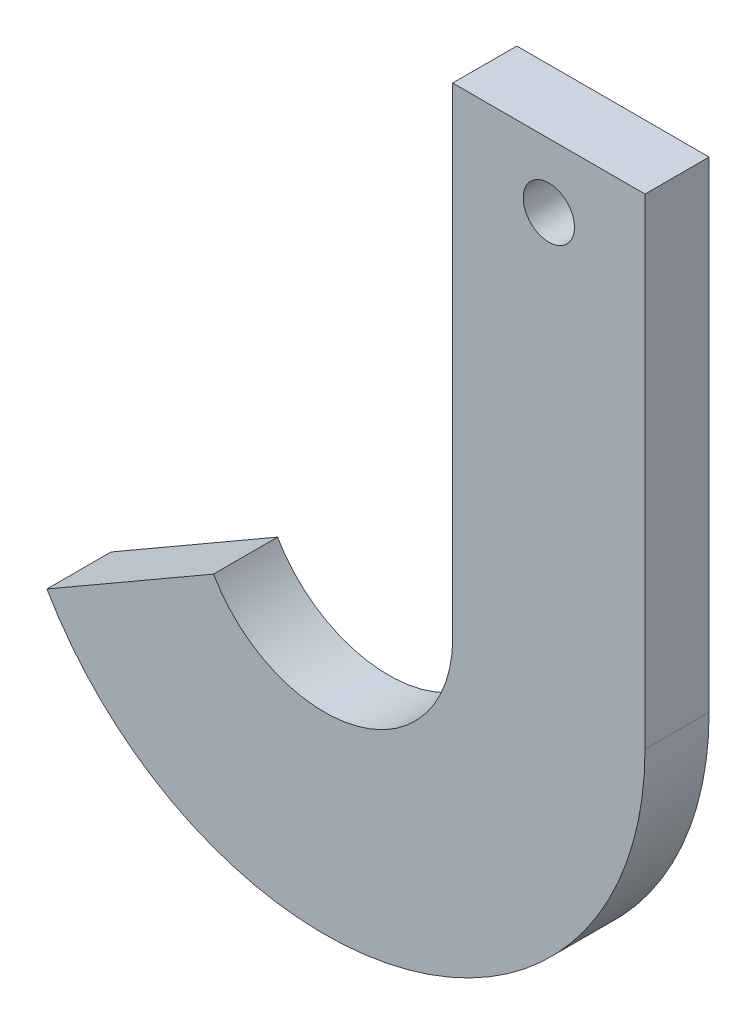
ISO-10303-21;
HEADER;
FILE_DESCRIPTION(('STEP AP214'),'2;1');
FILE_NAME('part.step','',(''),(''),'','','');
FILE_SCHEMA(('AUTOMOTIVE_DESIGN { 1 0 10303 214 1 1 1 1 }'));
ENDSEC;
DATA;
#1=APPLICATION_CONTEXT('core data for automotive mechanical design processes');
#2=APPLICATION_PROTOCOL_DEFINITION('international standard','automotive_design',2000,#1);
#3=PRODUCT_CONTEXT('',#1,'mechanical');
#4=PRODUCT('Part','Part','',(#3));
#5=PRODUCT_RELATED_PRODUCT_CATEGORY('part','',(#4));
#6=PRODUCT_DEFINITION_FORMATION('','',#4);
#7=PRODUCT_DEFINITION_CONTEXT('part definition',#1,'design');
#8=PRODUCT_DEFINITION('design','',#6,#7);
#9=PRODUCT_DEFINITION_SHAPE('','',#8);
#10=(LENGTH_UNIT() NAMED_UNIT(*) SI_UNIT(.MILLI.,.METRE.));
#11=(NAMED_UNIT(*) PLANE_ANGLE_UNIT() SI_UNIT($,.RADIAN.));
#12=(NAMED_UNIT(*) SI_UNIT($,.STERADIAN.) SOLID_ANGLE_UNIT());
#13=UNCERTAINTY_MEASURE_WITH_UNIT(LENGTH_MEASURE(1.E-05),#10,'distance_accuracy_value','');
#14=(GEOMETRIC_REPRESENTATION_CONTEXT(3) GLOBAL_UNCERTAINTY_ASSIGNED_CONTEXT((#13)) GLOBAL_UNIT_ASSIGNED_CONTEXT((#10,
#11,#12)) REPRESENTATION_CONTEXT('',''));
#15=CARTESIAN_POINT('',(0.,0.,0.));
#16=DIRECTION('',(0.,0.,1.));
#17=DIRECTION('',(1.,0.,0.));
#18=AXIS2_PLACEMENT_3D('',#15,#16,#17);
#19=CARTESIAN_POINT('',(0.,0.,20.));
#20=DIRECTION('',(0.,0.,1.));
#21=DIRECTION('',(1.,0.,0.));
#22=AXIS2_PLACEMENT_3D('',#19,#20,#21);
#23=PLANE('',#22);
#24=CARTESIAN_POINT('',(0.,0.,20.));
#25=DIRECTION('',(0.,0.,-1.));
#26=DIRECTION('',(1.,0.,0.));
#27=AXIS2_PLACEMENT_3D('',#24,#25,#26);
#28=CIRCLE('',#27,40.);
#29=CARTESIAN_POINT('',(40.,0.,20.));
#30=VERTEX_POINT('',#29);
#31=CARTESIAN_POINT('',(-34.6410161513775,-20.0000000000001,20.));
#32=VERTEX_POINT('',#31);
#33=EDGE_CURVE('E128',#30,#32,#28,.T.);
#34=ORIENTED_EDGE('',*,*,#33,.T.);
#35=DIRECTION('',(-0.866025403784438,-0.500000000000001,0.));
#36=VECTOR('',#35,1.);
#37=CARTESIAN_POINT('',(-34.6410161513775,-20.0000000000001,20.));
#38=LINE('',#37,#36);
#39=CARTESIAN_POINT('',(-86.6025403784438,-50.0000000000001,20.));
#40=VERTEX_POINT('',#39);
#41=EDGE_CURVE('E86',#32,#40,#38,.T.);
#42=ORIENTED_EDGE('',*,*,#41,.T.);
#43=CARTESIAN_POINT('',(0.,0.,20.));
#44=DIRECTION('',(0.,0.,1.));
#45=DIRECTION('',(1.,0.,0.));
#46=AXIS2_PLACEMENT_3D('',#43,#44,#45);
#47=CIRCLE('',#46,100.);
#48=CARTESIAN_POINT('',(100.,0.,20.));
#49=VERTEX_POINT('',#48);
#50=EDGE_CURVE('E99',#40,#49,#47,.T.);
#51=ORIENTED_EDGE('',*,*,#50,.T.);
#52=DIRECTION('',(0.,1.,0.));
#53=VECTOR('',#52,1.);
#54=CARTESIAN_POINT('',(100.,0.,20.));
#55=LINE('',#54,#53);
#56=CARTESIAN_POINT('',(100.,150.,20.));
#57=VERTEX_POINT('',#56);
#58=EDGE_CURVE('E93',#49,#57,#55,.T.);
#59=ORIENTED_EDGE('',*,*,#58,.T.);
#60=DIRECTION('',(-1.,0.,0.));
#61=VECTOR('',#60,1.);
#62=CARTESIAN_POINT('',(40.,150.,20.));
#63=LINE('',#62,#61);
#64=CARTESIAN_POINT('',(40.,150.,20.));
#65=VERTEX_POINT('',#64);
#66=EDGE_CURVE('E97',#57,#65,#63,.T.);
#67=ORIENTED_EDGE('',*,*,#66,.T.);
#68=DIRECTION('',(0.,-1.,0.));
#69=VECTOR('',#68,1.);
#70=CARTESIAN_POINT('',(40.,150.,20.));
#71=LINE('',#70,#69);
#72=EDGE_CURVE('E49',#65,#30,#71,.T.);
#73=ORIENTED_EDGE('',*,*,#72,.T.);
#74=EDGE_LOOP('',(#34,#42,#51,#59,#67,#73));
#75=FACE_BOUND('',#74,.T.);
#76=CARTESIAN_POINT('',(70.,130.,20.));
#77=DIRECTION('',(0.,0.,1.));
#78=DIRECTION('',(1.,0.,0.));
#79=AXIS2_PLACEMENT_3D('',#76,#77,#78);
#80=CIRCLE('',#79,8.00000000000001);
#81=CARTESIAN_POINT('',(78.,130.,20.));
#82=VERTEX_POINT('',#81);
#83=EDGE_CURVE('E121',#82,#82,#80,.T.);
#84=ORIENTED_EDGE('',*,*,#83,.F.);
#85=EDGE_LOOP('',(#84));
#86=FACE_BOUND('',#85,.T.);
#87=ADVANCED_FACE('F32',(#75,#86),#23,.T.);
#88=CARTESIAN_POINT('',(0.,0.,0.));
#89=DIRECTION('',(0.,0.,1.));
#90=DIRECTION('',(1.,0.,0.));
#91=AXIS2_PLACEMENT_3D('',#88,#89,#90);
#92=PLANE('',#91);
#93=CARTESIAN_POINT('',(0.,0.,0.));
#94=DIRECTION('',(0.,0.,-1.));
#95=DIRECTION('',(1.,0.,0.));
#96=AXIS2_PLACEMENT_3D('',#93,#94,#95);
#97=CIRCLE('',#96,40.);
#98=CARTESIAN_POINT('',(40.,0.,0.));
#99=VERTEX_POINT('',#98);
#100=CARTESIAN_POINT('',(-34.6410161513775,-20.0000000000001,0.));
#101=VERTEX_POINT('',#100);
#102=EDGE_CURVE('E117',#99,#101,#97,.T.);
#103=ORIENTED_EDGE('',*,*,#102,.F.);
#104=DIRECTION('',(0.,-1.,0.));
#105=VECTOR('',#104,1.);
#106=CARTESIAN_POINT('',(40.,150.,0.));
#107=LINE('',#106,#105);
#108=CARTESIAN_POINT('',(40.,150.,0.));
#109=VERTEX_POINT('',#108);
#110=EDGE_CURVE('E78',#109,#99,#107,.T.);
#111=ORIENTED_EDGE('',*,*,#110,.F.);
#112=DIRECTION('',(-1.,0.,0.));
#113=VECTOR('',#112,1.);
#114=CARTESIAN_POINT('',(40.,150.,0.));
#115=LINE('',#114,#113);
#116=CARTESIAN_POINT('',(100.,150.,0.));
#117=VERTEX_POINT('',#116);
#118=EDGE_CURVE('E72',#117,#109,#115,.T.);
#119=ORIENTED_EDGE('',*,*,#118,.F.);
#120=DIRECTION('',(0.,1.,0.));
#121=VECTOR('',#120,1.);
#122=CARTESIAN_POINT('',(100.,0.,0.));
#123=LINE('',#122,#121);
#124=CARTESIAN_POINT('',(100.,0.,0.));
#125=VERTEX_POINT('',#124);
#126=EDGE_CURVE('E107',#125,#117,#123,.T.);
#127=ORIENTED_EDGE('',*,*,#126,.F.);
#128=CARTESIAN_POINT('',(0.,0.,0.));
#129=DIRECTION('',(0.,0.,1.));
#130=DIRECTION('',(1.,0.,0.));
#131=AXIS2_PLACEMENT_3D('',#128,#129,#130);
#132=CIRCLE('',#131,100.);
#133=CARTESIAN_POINT('',(-86.6025403784438,-50.0000000000001,0.));
#134=VERTEX_POINT('',#133);
#135=EDGE_CURVE('E123',#134,#125,#132,.T.);
#136=ORIENTED_EDGE('',*,*,#135,.F.);
#137=DIRECTION('',(-0.866025403784438,-0.500000000000001,0.));
#138=VECTOR('',#137,1.);
#139=CARTESIAN_POINT('',(-34.6410161513775,-20.0000000000001,0.));
#140=LINE('',#139,#138);
#141=EDGE_CURVE('E120',#101,#134,#140,.T.);
#142=ORIENTED_EDGE('',*,*,#141,.F.);
#143=EDGE_LOOP('',(#103,#111,#119,#127,#136,#142));
#144=FACE_BOUND('',#143,.T.);
#145=CARTESIAN_POINT('',(70.,130.,0.));
#146=DIRECTION('',(0.,0.,1.));
#147=DIRECTION('',(1.,0.,0.));
#148=AXIS2_PLACEMENT_3D('',#145,#146,#147);
#149=CIRCLE('',#148,8.00000000000001);
#150=CARTESIAN_POINT('',(78.,130.,0.));
#151=VERTEX_POINT('',#150);
#152=EDGE_CURVE('E221',#151,#151,#149,.T.);
#153=ORIENTED_EDGE('',*,*,#152,.T.);
#154=EDGE_LOOP('',(#153));
#155=FACE_BOUND('',#154,.T.);
#156=ADVANCED_FACE('F137',(#144,#155),#92,.F.);
#157=CARTESIAN_POINT('',(0.,0.,20.));
#158=DIRECTION('',(0.,0.,-1.));
#159=DIRECTION('',(-1.,0.,0.));
#160=AXIS2_PLACEMENT_3D('',#157,#158,#159);
#161=CYLINDRICAL_SURFACE('',#160,40.);
#162=ORIENTED_EDGE('',*,*,#102,.T.);
#163=DIRECTION('',(0.,0.,-1.));
#164=VECTOR('',#163,1.);
#165=CARTESIAN_POINT('',(-34.6410161513775,-20.0000000000001,20.));
#166=LINE('',#165,#164);
#167=EDGE_CURVE('E11',#32,#101,#166,.T.);
#168=ORIENTED_EDGE('',*,*,#167,.F.);
#169=ORIENTED_EDGE('',*,*,#33,.F.);
#170=DIRECTION('',(0.,0.,-1.));
#171=VECTOR('',#170,1.);
#172=CARTESIAN_POINT('',(40.,0.,20.));
#173=LINE('',#172,#171);
#174=EDGE_CURVE('E113',#30,#99,#173,.T.);
#175=ORIENTED_EDGE('',*,*,#174,.T.);
#176=EDGE_LOOP('',(#162,#168,#169,#175));
#177=FACE_BOUND('',#176,.T.);
#178=ADVANCED_FACE('F34',(#177),#161,.F.);
#179=CARTESIAN_POINT('',(-34.6410161513775,-20.0000000000001,20.));
#180=DIRECTION('',(0.500000000000001,-0.866025403784438,0.));
#181=DIRECTION('',(0.866025403784438,0.500000000000001,0.));
#182=AXIS2_PLACEMENT_3D('',#179,#180,#181);
#183=PLANE('',#182);
#184=ORIENTED_EDGE('',*,*,#141,.T.);
#185=DIRECTION('',(0.,0.,-1.));
#186=VECTOR('',#185,1.);
#187=CARTESIAN_POINT('',(-86.6025403784438,-50.0000000000001,20.));
#188=LINE('',#187,#186);
#189=EDGE_CURVE('E41',#40,#134,#188,.T.);
#190=ORIENTED_EDGE('',*,*,#189,.F.);
#191=ORIENTED_EDGE('',*,*,#41,.F.);
#192=ORIENTED_EDGE('',*,*,#167,.T.);
#193=EDGE_LOOP('',(#184,#190,#191,#192));
#194=FACE_BOUND('',#193,.T.);
#195=ADVANCED_FACE('F162',(#194),#183,.F.);
#196=CARTESIAN_POINT('',(0.,0.,20.));
#197=DIRECTION('',(0.,0.,-1.));
#198=DIRECTION('',(-1.,0.,0.));
#199=AXIS2_PLACEMENT_3D('',#196,#197,#198);
#200=CYLINDRICAL_SURFACE('',#199,100.);
#201=ORIENTED_EDGE('',*,*,#135,.T.);
#202=DIRECTION('',(0.,0.,-1.));
#203=VECTOR('',#202,1.);
#204=CARTESIAN_POINT('',(100.,0.,20.));
#205=LINE('',#204,#203);
#206=EDGE_CURVE('E108',#49,#125,#205,.T.);
#207=ORIENTED_EDGE('',*,*,#206,.F.);
#208=ORIENTED_EDGE('',*,*,#50,.F.);
#209=ORIENTED_EDGE('',*,*,#189,.T.);
#210=EDGE_LOOP('',(#201,#207,#208,#209));
#211=FACE_BOUND('',#210,.T.);
#212=ADVANCED_FACE('F134',(#211),#200,.T.);
#213=CARTESIAN_POINT('',(100.,0.,20.));
#214=DIRECTION('',(-1.,0.,0.));
#215=DIRECTION('',(0.,0.,1.));
#216=AXIS2_PLACEMENT_3D('',#213,#214,#215);
#217=PLANE('',#216);
#218=ORIENTED_EDGE('',*,*,#126,.T.);
#219=DIRECTION('',(0.,0.,-1.));
#220=VECTOR('',#219,1.);
#221=CARTESIAN_POINT('',(100.,150.,20.));
#222=LINE('',#221,#220);
#223=EDGE_CURVE('E104',#57,#117,#222,.T.);
#224=ORIENTED_EDGE('',*,*,#223,.F.);
#225=ORIENTED_EDGE('',*,*,#58,.F.);
#226=ORIENTED_EDGE('',*,*,#206,.T.);
#227=EDGE_LOOP('',(#218,#224,#225,#226));
#228=FACE_BOUND('',#227,.T.);
#229=ADVANCED_FACE('F105',(#228),#217,.F.);
#230=CARTESIAN_POINT('',(40.,150.,20.));
#231=DIRECTION('',(0.,-1.,0.));
#232=DIRECTION('',(0.,0.,-1.));
#233=AXIS2_PLACEMENT_3D('',#230,#231,#232);
#234=PLANE('',#233);
#235=ORIENTED_EDGE('',*,*,#118,.T.);
#236=DIRECTION('',(0.,0.,-1.));
#237=VECTOR('',#236,1.);
#238=CARTESIAN_POINT('',(40.,150.,20.));
#239=LINE('',#238,#237);
#240=EDGE_CURVE('E109',#65,#109,#239,.T.);
#241=ORIENTED_EDGE('',*,*,#240,.F.);
#242=ORIENTED_EDGE('',*,*,#66,.F.);
#243=ORIENTED_EDGE('',*,*,#223,.T.);
#244=EDGE_LOOP('',(#235,#241,#242,#243));
#245=FACE_BOUND('',#244,.T.);
#246=ADVANCED_FACE('F111',(#245),#234,.F.);
#247=CARTESIAN_POINT('',(40.,150.,20.));
#248=DIRECTION('',(1.,0.,0.));
#249=DIRECTION('',(0.,1.,0.));
#250=AXIS2_PLACEMENT_3D('',#247,#248,#249);
#251=PLANE('',#250);
#252=ORIENTED_EDGE('',*,*,#110,.T.);
#253=ORIENTED_EDGE('',*,*,#174,.F.);
#254=ORIENTED_EDGE('',*,*,#72,.F.);
#255=ORIENTED_EDGE('',*,*,#240,.T.);
#256=EDGE_LOOP('',(#252,#253,#254,#255));
#257=FACE_BOUND('',#256,.T.);
#258=ADVANCED_FACE('F142',(#257),#251,.F.);
#259=CARTESIAN_POINT('',(70.,130.,20.));
#260=DIRECTION('',(0.,0.,-1.));
#261=DIRECTION('',(-1.,0.,0.));
#262=AXIS2_PLACEMENT_3D('',#259,#260,#261);
#263=CYLINDRICAL_SURFACE('',#262,8.00000000000001);
#264=ORIENTED_EDGE('',*,*,#83,.T.);
#265=EDGE_LOOP('',(#264));
#266=FACE_BOUND('',#265,.T.);
#267=ORIENTED_EDGE('',*,*,#152,.F.);
#268=EDGE_LOOP('',(#267));
#269=FACE_BOUND('',#268,.T.);
#270=ADVANCED_FACE('F144',(#266,#269),#263,.F.);
#271=CLOSED_SHELL('',(#87,#156,#178,#195,#212,#229,#246,#258,#270));
#272=MANIFOLD_SOLID_BREP('B2',#271);
#273=ADVANCED_BREP_SHAPE_REPRESENTATION('',(#18,#272),#14);
#274=SHAPE_DEFINITION_REPRESENTATION(#9,#273);
ENDSEC;
END-ISO-10303-21;
